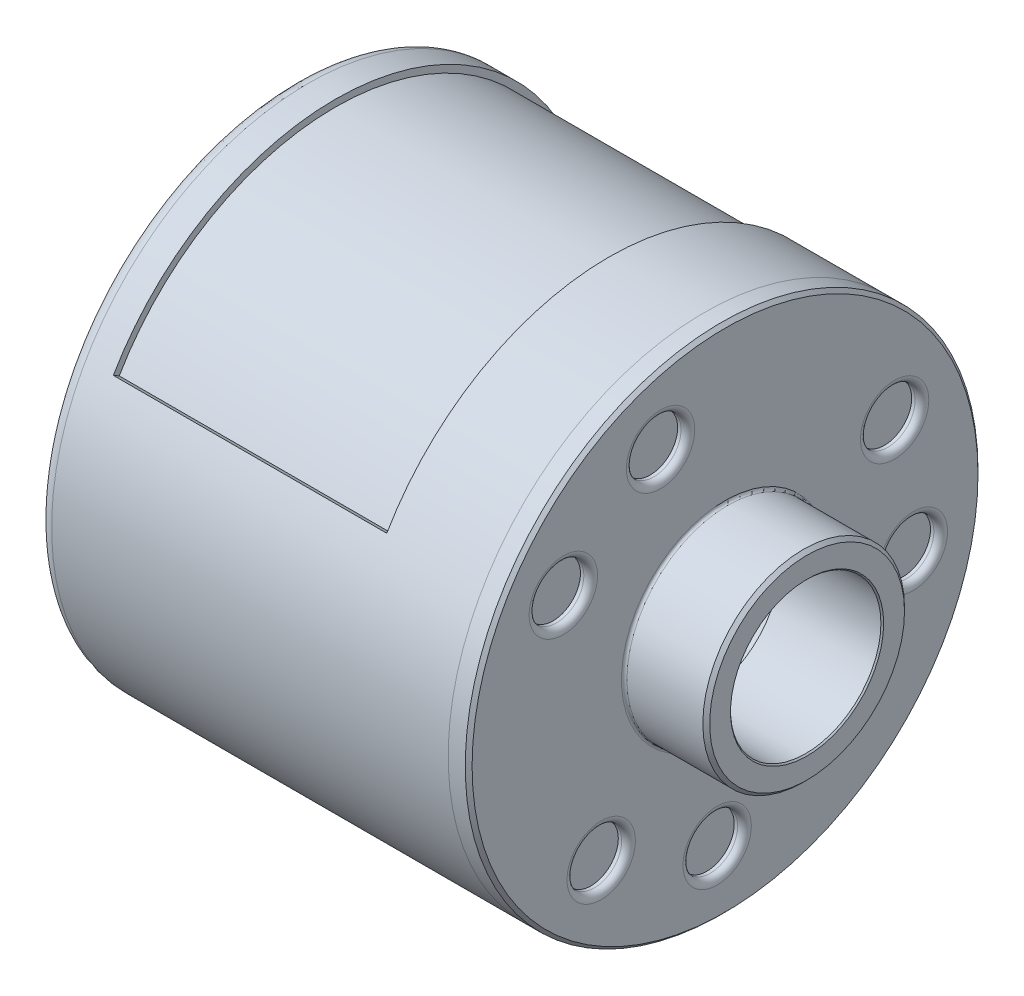
ISO-10303-21;
HEADER;
FILE_DESCRIPTION(('STEP AP214'),'2;1');
FILE_NAME('part.step','',(''),(''),'','','');
FILE_SCHEMA(('AUTOMOTIVE_DESIGN { 1 0 10303 214 1 1 1 1 }'));
ENDSEC;
DATA;
#1=APPLICATION_CONTEXT('core data for automotive mechanical design processes');
#2=APPLICATION_PROTOCOL_DEFINITION('international standard','automotive_design',2000,#1);
#3=PRODUCT_CONTEXT('',#1,'mechanical');
#4=PRODUCT('Part','Part','',(#3));
#5=PRODUCT_RELATED_PRODUCT_CATEGORY('part','',(#4));
#6=PRODUCT_DEFINITION_FORMATION('','',#4);
#7=PRODUCT_DEFINITION_CONTEXT('part definition',#1,'design');
#8=PRODUCT_DEFINITION('design','',#6,#7);
#9=PRODUCT_DEFINITION_SHAPE('','',#8);
#10=(LENGTH_UNIT() NAMED_UNIT(*) SI_UNIT(.MILLI.,.METRE.));
#11=(NAMED_UNIT(*) PLANE_ANGLE_UNIT() SI_UNIT($,.RADIAN.));
#12=(NAMED_UNIT(*) SI_UNIT($,.STERADIAN.) SOLID_ANGLE_UNIT());
#13=UNCERTAINTY_MEASURE_WITH_UNIT(LENGTH_MEASURE(1.E-05),#10,'distance_accuracy_value','');
#14=(GEOMETRIC_REPRESENTATION_CONTEXT(3) GLOBAL_UNCERTAINTY_ASSIGNED_CONTEXT((#13)) GLOBAL_UNIT_ASSIGNED_CONTEXT((#10,
#11,#12)) REPRESENTATION_CONTEXT('',''));
#15=CARTESIAN_POINT('',(0.,0.,0.));
#16=DIRECTION('',(0.,0.,1.));
#17=DIRECTION('',(1.,0.,0.));
#18=AXIS2_PLACEMENT_3D('',#15,#16,#17);
#19=CARTESIAN_POINT('',(63.,0.,0.));
#20=DIRECTION('',(-1.,0.,0.));
#21=DIRECTION('',(0.,0.,1.));
#22=AXIS2_PLACEMENT_3D('',#19,#20,#21);
#23=CYLINDRICAL_SURFACE('',#22,37.5);
#24=CARTESIAN_POINT('',(62.5,0.,0.));
#25=DIRECTION('',(1.,0.,0.));
#26=DIRECTION('',(0.,0.,-1.));
#27=AXIS2_PLACEMENT_3D('',#24,#25,#26);
#28=CIRCLE('',#27,37.5);
#29=CARTESIAN_POINT('',(62.5,0.,-37.5));
#30=VERTEX_POINT('',#29);
#31=EDGE_CURVE('E107',#30,#30,#28,.F.);
#32=ORIENTED_EDGE('',*,*,#31,.T.);
#33=EDGE_LOOP('',(#32));
#34=FACE_BOUND('',#33,.T.);
#35=CARTESIAN_POINT('',(60.,0.,0.));
#36=DIRECTION('',(1.,0.,0.));
#37=DIRECTION('',(0.,0.,-1.));
#38=AXIS2_PLACEMENT_3D('',#35,#36,#37);
#39=CIRCLE('',#38,37.5);
#40=CARTESIAN_POINT('',(60.,0.,-37.5));
#41=VERTEX_POINT('',#40);
#42=EDGE_CURVE('E94',#41,#41,#39,.T.);
#43=ORIENTED_EDGE('',*,*,#42,.T.);
#44=EDGE_LOOP('',(#43));
#45=FACE_BOUND('',#44,.T.);
#46=ADVANCED_FACE('F46',(#34,#45),#23,.T.);
#47=CARTESIAN_POINT('',(63.,0.,0.));
#48=DIRECTION('',(1.,0.,0.));
#49=DIRECTION('',(0.,0.,-1.));
#50=AXIS2_PLACEMENT_3D('',#47,#48,#49);
#51=PLANE('',#50);
#52=CARTESIAN_POINT('',(63.,14.9873391476045,23.6512085372952));
#53=DIRECTION('',(1.,0.,0.));
#54=DIRECTION('',(0.,0.,-1.));
#55=AXIS2_PLACEMENT_3D('',#52,#53,#54);
#56=CIRCLE('',#55,5.);
#57=CARTESIAN_POINT('',(63.,14.9873391476045,18.6512085372952));
#58=VERTEX_POINT('',#57);
#59=EDGE_CURVE('E57',#58,#58,#56,.F.);
#60=ORIENTED_EDGE('',*,*,#59,.T.);
#61=EDGE_LOOP('',(#60));
#62=FACE_BOUND('',#61,.T.);
#63=CARTESIAN_POINT('',(63.,-27.9762169973053,1.15381216831106));
#64=DIRECTION('',(1.,0.,0.));
#65=DIRECTION('',(0.,0.,-1.));
#66=AXIS2_PLACEMENT_3D('',#63,#64,#65);
#67=CIRCLE('',#66,5.);
#68=CARTESIAN_POINT('',(63.,-27.9762169973053,-3.84618783168894));
#69=VERTEX_POINT('',#68);
#70=EDGE_CURVE('E61',#69,#69,#67,.F.);
#71=ORIENTED_EDGE('',*,*,#70,.T.);
#72=EDGE_LOOP('',(#71));
#73=FACE_BOUND('',#72,.T.);
#74=CARTESIAN_POINT('',(63.,12.9888778496976,-24.8050207056078));
#75=DIRECTION('',(1.,0.,0.));
#76=DIRECTION('',(0.,0.,-1.));
#77=AXIS2_PLACEMENT_3D('',#74,#75,#76);
#78=CIRCLE('',#77,5.);
#79=CARTESIAN_POINT('',(63.,12.9888778496976,-29.8050207056078));
#80=VERTEX_POINT('',#79);
#81=EDGE_CURVE('E66',#80,#80,#78,.F.);
#82=ORIENTED_EDGE('',*,*,#81,.T.);
#83=EDGE_LOOP('',(#82));
#84=FACE_BOUND('',#83,.T.);
#85=CARTESIAN_POINT('',(63.,-21.3516493882719,18.1137259667996));
#86=DIRECTION('',(1.,0.,0.));
#87=DIRECTION('',(0.,0.,-1.));
#88=AXIS2_PLACEMENT_3D('',#85,#86,#87);
#89=CIRCLE('',#88,5.);
#90=CARTESIAN_POINT('',(63.,-21.3516493882719,13.1137259667996));
#91=VERTEX_POINT('',#90);
#92=EDGE_CURVE('E75',#91,#91,#89,.F.);
#93=ORIENTED_EDGE('',*,*,#92,.T.);
#94=EDGE_LOOP('',(#93));
#95=FACE_BOUND('',#94,.T.);
#96=CARTESIAN_POINT('',(63.,26.3627715385742,9.43420779954214));
#97=DIRECTION('',(1.,0.,0.));
#98=DIRECTION('',(0.,0.,-1.));
#99=AXIS2_PLACEMENT_3D('',#96,#97,#98);
#100=CIRCLE('',#99,5.);
#101=CARTESIAN_POINT('',(63.,26.3627715385742,4.43420779954214));
#102=VERTEX_POINT('',#101);
#103=EDGE_CURVE('E78',#102,#102,#100,.F.);
#104=ORIENTED_EDGE('',*,*,#103,.T.);
#105=EDGE_LOOP('',(#104));
#106=FACE_BOUND('',#105,.T.);
#107=CARTESIAN_POINT('',(63.,-5.01112215030235,-27.5479337663417));
#108=DIRECTION('',(1.,0.,0.));
#109=DIRECTION('',(0.,0.,-1.));
#110=AXIS2_PLACEMENT_3D('',#107,#108,#109);
#111=CIRCLE('',#110,5.);
#112=CARTESIAN_POINT('',(63.,-5.01112215030235,-32.5479337663417));
#113=VERTEX_POINT('',#112);
#114=EDGE_CURVE('E84',#113,#113,#111,.F.);
#115=ORIENTED_EDGE('',*,*,#114,.T.);
#116=EDGE_LOOP('',(#115));
#117=FACE_BOUND('',#116,.T.);
#118=CARTESIAN_POINT('',(63.,0.,0.));
#119=DIRECTION('',(1.,0.,0.));
#120=DIRECTION('',(0.,0.,-1.));
#121=AXIS2_PLACEMENT_3D('',#118,#119,#120);
#122=CIRCLE('',#121,37.);
#123=CARTESIAN_POINT('',(63.,0.,-37.));
#124=VERTEX_POINT('',#123);
#125=EDGE_CURVE('E110',#124,#124,#122,.T.);
#126=ORIENTED_EDGE('',*,*,#125,.T.);
#127=EDGE_LOOP('',(#126));
#128=FACE_BOUND('',#127,.T.);
#129=CARTESIAN_POINT('',(63.,0.,0.));
#130=DIRECTION('',(1.,0.,0.));
#131=DIRECTION('',(0.,0.,-1.));
#132=AXIS2_PLACEMENT_3D('',#129,#130,#131);
#133=CIRCLE('',#132,15.15);
#134=CARTESIAN_POINT('',(63.,0.,-15.15));
#135=VERTEX_POINT('',#134);
#136=EDGE_CURVE('E113',#135,#135,#133,.F.);
#137=ORIENTED_EDGE('',*,*,#136,.T.);
#138=EDGE_LOOP('',(#137));
#139=FACE_BOUND('',#138,.T.);
#140=ADVANCED_FACE('F157',(#62,#73,#84,#95,#106,#117,#128,#139),#51,.T.);
#141=CARTESIAN_POINT('',(60.,0.,0.));
#142=DIRECTION('',(1.,0.,0.));
#143=DIRECTION('',(0.,0.,-1.));
#144=AXIS2_PLACEMENT_3D('',#141,#142,#143);
#145=PLANE('',#144);
#146=CARTESIAN_POINT('',(60.,0.,0.));
#147=DIRECTION('',(1.,0.,0.));
#148=DIRECTION('',(0.,0.,-1.));
#149=AXIS2_PLACEMENT_3D('',#146,#147,#148);
#150=CIRCLE('',#149,11.);
#151=CARTESIAN_POINT('',(60.,0.,-11.));
#152=VERTEX_POINT('',#151);
#153=EDGE_CURVE('E91',#152,#152,#150,.T.);
#154=ORIENTED_EDGE('',*,*,#153,.T.);
#155=EDGE_LOOP('',(#154));
#156=FACE_BOUND('',#155,.T.);
#157=ORIENTED_EDGE('',*,*,#42,.F.);
#158=EDGE_LOOP('',(#157));
#159=FACE_BOUND('',#158,.T.);
#160=ADVANCED_FACE('F163',(#156,#159),#145,.F.);
#161=CARTESIAN_POINT('',(75.,0.,0.));
#162=DIRECTION('',(-1.,0.,0.));
#163=DIRECTION('',(0.,0.,1.));
#164=AXIS2_PLACEMENT_3D('',#161,#162,#163);
#165=CYLINDRICAL_SURFACE('',#164,11.);
#166=CARTESIAN_POINT('',(74.8,0.,0.));
#167=DIRECTION('',(1.,0.,0.));
#168=DIRECTION('',(0.,0.,-1.));
#169=AXIS2_PLACEMENT_3D('',#166,#167,#168);
#170=CIRCLE('',#169,11.);
#171=CARTESIAN_POINT('',(74.8,0.,-11.));
#172=VERTEX_POINT('',#171);
#173=EDGE_CURVE('E98',#172,#172,#170,.T.);
#174=ORIENTED_EDGE('',*,*,#173,.T.);
#175=EDGE_LOOP('',(#174));
#176=FACE_BOUND('',#175,.T.);
#177=ORIENTED_EDGE('',*,*,#153,.F.);
#178=EDGE_LOOP('',(#177));
#179=FACE_BOUND('',#178,.T.);
#180=ADVANCED_FACE('F229',(#176,#179),#165,.F.);
#181=CARTESIAN_POINT('',(75.,0.,0.));
#182=DIRECTION('',(-1.,0.,0.));
#183=DIRECTION('',(0.,0.,1.));
#184=AXIS2_PLACEMENT_3D('',#181,#182,#183);
#185=CYLINDRICAL_SURFACE('',#184,14.75);
#186=CARTESIAN_POINT('',(74.5,0.,0.));
#187=DIRECTION('',(1.,0.,0.));
#188=DIRECTION('',(0.,0.,-1.));
#189=AXIS2_PLACEMENT_3D('',#186,#187,#188);
#190=CIRCLE('',#189,14.75);
#191=CARTESIAN_POINT('',(74.5,0.,-14.75));
#192=VERTEX_POINT('',#191);
#193=EDGE_CURVE('E101',#192,#192,#190,.F.);
#194=ORIENTED_EDGE('',*,*,#193,.T.);
#195=EDGE_LOOP('',(#194));
#196=FACE_BOUND('',#195,.T.);
#197=CARTESIAN_POINT('',(63.4,0.,0.));
#198=DIRECTION('',(1.,0.,0.));
#199=DIRECTION('',(0.,0.,-1.));
#200=AXIS2_PLACEMENT_3D('',#197,#198,#199);
#201=CIRCLE('',#200,14.75);
#202=CARTESIAN_POINT('',(63.4,0.,-14.75));
#203=VERTEX_POINT('',#202);
#204=EDGE_CURVE('E116',#203,#203,#201,.T.);
#205=ORIENTED_EDGE('',*,*,#204,.T.);
#206=EDGE_LOOP('',(#205));
#207=FACE_BOUND('',#206,.T.);
#208=ADVANCED_FACE('F227',(#196,#207),#185,.T.);
#209=CARTESIAN_POINT('',(75.,0.,0.));
#210=DIRECTION('',(1.,0.,0.));
#211=DIRECTION('',(0.,0.,-1.));
#212=AXIS2_PLACEMENT_3D('',#209,#210,#211);
#213=PLANE('',#212);
#214=CARTESIAN_POINT('',(75.,0.,0.));
#215=DIRECTION('',(1.,0.,0.));
#216=DIRECTION('',(0.,0.,-1.));
#217=AXIS2_PLACEMENT_3D('',#214,#215,#216);
#218=CIRCLE('',#217,11.2);
#219=CARTESIAN_POINT('',(75.,0.,-11.2));
#220=VERTEX_POINT('',#219);
#221=EDGE_CURVE('E90',#220,#220,#218,.F.);
#222=ORIENTED_EDGE('',*,*,#221,.T.);
#223=EDGE_LOOP('',(#222));
#224=FACE_BOUND('',#223,.T.);
#225=CARTESIAN_POINT('',(75.,0.,0.));
#226=DIRECTION('',(1.,0.,0.));
#227=DIRECTION('',(0.,0.,-1.));
#228=AXIS2_PLACEMENT_3D('',#225,#226,#227);
#229=CIRCLE('',#228,14.25);
#230=CARTESIAN_POINT('',(75.,0.,-14.25));
#231=VERTEX_POINT('',#230);
#232=EDGE_CURVE('E104',#231,#231,#229,.T.);
#233=ORIENTED_EDGE('',*,*,#232,.T.);
#234=EDGE_LOOP('',(#233));
#235=FACE_BOUND('',#234,.T.);
#236=ADVANCED_FACE('F173',(#224,#235),#213,.T.);
#237=CARTESIAN_POINT('',(63.4,0.,0.));
#238=DIRECTION('',(1.,0.,0.));
#239=DIRECTION('',(0.,0.,-1.));
#240=AXIS2_PLACEMENT_3D('',#237,#238,#239);
#241=TOROIDAL_SURFACE('',#240,15.15,0.4);
#242=ORIENTED_EDGE('',*,*,#136,.F.);
#243=EDGE_LOOP('',(#242));
#244=FACE_BOUND('',#243,.T.);
#245=ORIENTED_EDGE('',*,*,#204,.F.);
#246=EDGE_LOOP('',(#245));
#247=FACE_BOUND('',#246,.T.);
#248=ADVANCED_FACE('F169',(#244,#247),#241,.F.);
#249=CARTESIAN_POINT('',(63.,0.,0.));
#250=DIRECTION('',(-1.,0.,0.));
#251=DIRECTION('',(0.,0.,1.));
#252=AXIS2_PLACEMENT_3D('',#249,#250,#251);
#253=CONICAL_SURFACE('',#252,37.,0.785398163397455);
#254=ORIENTED_EDGE('',*,*,#31,.F.);
#255=EDGE_LOOP('',(#254));
#256=FACE_BOUND('',#255,.T.);
#257=ORIENTED_EDGE('',*,*,#125,.F.);
#258=EDGE_LOOP('',(#257));
#259=FACE_BOUND('',#258,.T.);
#260=ADVANCED_FACE('F172',(#256,#259),#253,.T.);
#261=CARTESIAN_POINT('',(75.,0.,0.));
#262=DIRECTION('',(-1.,0.,0.));
#263=DIRECTION('',(0.,0.,1.));
#264=AXIS2_PLACEMENT_3D('',#261,#262,#263);
#265=CONICAL_SURFACE('',#264,14.25,0.785398163397452);
#266=ORIENTED_EDGE('',*,*,#193,.F.);
#267=EDGE_LOOP('',(#266));
#268=FACE_BOUND('',#267,.T.);
#269=ORIENTED_EDGE('',*,*,#232,.F.);
#270=EDGE_LOOP('',(#269));
#271=FACE_BOUND('',#270,.T.);
#272=ADVANCED_FACE('F177',(#268,#271),#265,.T.);
#273=CARTESIAN_POINT('',(74.8,0.,0.));
#274=DIRECTION('',(1.,0.,0.));
#275=DIRECTION('',(0.,0.,-1.));
#276=AXIS2_PLACEMENT_3D('',#273,#274,#275);
#277=CONICAL_SURFACE('',#276,11.,0.785398163397479);
#278=ORIENTED_EDGE('',*,*,#221,.F.);
#279=EDGE_LOOP('',(#278));
#280=FACE_BOUND('',#279,.T.);
#281=ORIENTED_EDGE('',*,*,#173,.F.);
#282=EDGE_LOOP('',(#281));
#283=FACE_BOUND('',#282,.T.);
#284=ADVANCED_FACE('F181',(#280,#283),#277,.F.);
#285=CARTESIAN_POINT('',(61.5,12.9888778496976,-24.8050207056078));
#286=DIRECTION('',(1.,0.,0.));
#287=DIRECTION('',(0.,0.,-1.));
#288=AXIS2_PLACEMENT_3D('',#285,#286,#287);
#289=CYLINDRICAL_SURFACE('',#288,4.);
#290=CARTESIAN_POINT('',(62.,12.9888778496976,-24.8050207056078));
#291=DIRECTION('',(1.,0.,0.));
#292=DIRECTION('',(0.,0.,-1.));
#293=AXIS2_PLACEMENT_3D('',#290,#291,#292);
#294=CIRCLE('',#293,4.);
#295=CARTESIAN_POINT('',(62.,12.9888778496976,-28.8050207056078));
#296=VERTEX_POINT('',#295);
#297=EDGE_CURVE('E11',#296,#296,#294,.T.);
#298=ORIENTED_EDGE('',*,*,#297,.T.);
#299=EDGE_LOOP('',(#298));
#300=FACE_BOUND('',#299,.T.);
#301=CARTESIAN_POINT('',(61.5,12.9888778496976,-24.8050207056078));
#302=DIRECTION('',(1.,0.,0.));
#303=DIRECTION('',(0.,0.,-1.));
#304=AXIS2_PLACEMENT_3D('',#301,#302,#303);
#305=CIRCLE('',#304,4.);
#306=CARTESIAN_POINT('',(61.5,12.9888778496976,-28.8050207056078));
#307=VERTEX_POINT('',#306);
#308=EDGE_CURVE('E95',#307,#307,#305,.T.);
#309=ORIENTED_EDGE('',*,*,#308,.F.);
#310=EDGE_LOOP('',(#309));
#311=FACE_BOUND('',#310,.T.);
#312=ADVANCED_FACE('F152',(#300,#311),#289,.F.);
#313=CARTESIAN_POINT('',(61.5,12.9888778496976,-24.8050207056078));
#314=DIRECTION('',(1.,0.,0.));
#315=DIRECTION('',(0.,0.,-1.));
#316=AXIS2_PLACEMENT_3D('',#313,#314,#315);
#317=PLANE('',#316);
#318=ORIENTED_EDGE('',*,*,#308,.T.);
#319=EDGE_LOOP('',(#318));
#320=FACE_BOUND('',#319,.T.);
#321=ADVANCED_FACE('F143',(#320),#317,.T.);
#322=CARTESIAN_POINT('',(61.5,14.9873391476045,23.6512085372952));
#323=DIRECTION('',(1.,0.,0.));
#324=DIRECTION('',(0.,0.,-1.));
#325=AXIS2_PLACEMENT_3D('',#322,#323,#324);
#326=CYLINDRICAL_SURFACE('',#325,4.);
#327=CARTESIAN_POINT('',(62.,14.9873391476045,23.6512085372952));
#328=DIRECTION('',(1.,0.,0.));
#329=DIRECTION('',(0.,0.,-1.));
#330=AXIS2_PLACEMENT_3D('',#327,#328,#329);
#331=CIRCLE('',#330,4.);
#332=CARTESIAN_POINT('',(62.,14.9873391476045,19.6512085372952));
#333=VERTEX_POINT('',#332);
#334=EDGE_CURVE('E69',#333,#333,#331,.T.);
#335=ORIENTED_EDGE('',*,*,#334,.T.);
#336=EDGE_LOOP('',(#335));
#337=FACE_BOUND('',#336,.T.);
#338=CARTESIAN_POINT('',(61.5,14.9873391476045,23.6512085372952));
#339=DIRECTION('',(1.,0.,0.));
#340=DIRECTION('',(0.,0.,-1.));
#341=AXIS2_PLACEMENT_3D('',#338,#339,#340);
#342=CIRCLE('',#341,4.);
#343=CARTESIAN_POINT('',(61.5,14.9873391476045,19.6512085372952));
#344=VERTEX_POINT('',#343);
#345=EDGE_CURVE('E133',#344,#344,#342,.T.);
#346=ORIENTED_EDGE('',*,*,#345,.F.);
#347=EDGE_LOOP('',(#346));
#348=FACE_BOUND('',#347,.T.);
#349=ADVANCED_FACE('F141',(#337,#348),#326,.F.);
#350=CARTESIAN_POINT('',(61.5,14.9873391476045,23.6512085372952));
#351=DIRECTION('',(1.,0.,0.));
#352=DIRECTION('',(0.,0.,-1.));
#353=AXIS2_PLACEMENT_3D('',#350,#351,#352);
#354=PLANE('',#353);
#355=ORIENTED_EDGE('',*,*,#345,.T.);
#356=EDGE_LOOP('',(#355));
#357=FACE_BOUND('',#356,.T.);
#358=ADVANCED_FACE('F139',(#357),#354,.T.);
#359=CARTESIAN_POINT('',(61.5,-5.01112215030235,-27.5479337663417));
#360=DIRECTION('',(1.,0.,0.));
#361=DIRECTION('',(0.,0.,-1.));
#362=AXIS2_PLACEMENT_3D('',#359,#360,#361);
#363=CYLINDRICAL_SURFACE('',#362,4.);
#364=CARTESIAN_POINT('',(62.,-5.01112215030235,-27.5479337663417));
#365=DIRECTION('',(1.,0.,0.));
#366=DIRECTION('',(0.,0.,-1.));
#367=AXIS2_PLACEMENT_3D('',#364,#365,#366);
#368=CIRCLE('',#367,4.);
#369=CARTESIAN_POINT('',(62.,-5.01112215030235,-31.5479337663417));
#370=VERTEX_POINT('',#369);
#371=EDGE_CURVE('E87',#370,#370,#368,.T.);
#372=ORIENTED_EDGE('',*,*,#371,.T.);
#373=EDGE_LOOP('',(#372));
#374=FACE_BOUND('',#373,.T.);
#375=CARTESIAN_POINT('',(61.5,-5.01112215030235,-27.5479337663417));
#376=DIRECTION('',(1.,0.,0.));
#377=DIRECTION('',(0.,0.,-1.));
#378=AXIS2_PLACEMENT_3D('',#375,#376,#377);
#379=CIRCLE('',#378,4.);
#380=CARTESIAN_POINT('',(61.5,-5.01112215030235,-31.5479337663417));
#381=VERTEX_POINT('',#380);
#382=EDGE_CURVE('E123',#381,#381,#379,.T.);
#383=ORIENTED_EDGE('',*,*,#382,.F.);
#384=EDGE_LOOP('',(#383));
#385=FACE_BOUND('',#384,.T.);
#386=ADVANCED_FACE('F150',(#374,#385),#363,.F.);
#387=CARTESIAN_POINT('',(61.5,-5.01112215030235,-27.5479337663417));
#388=DIRECTION('',(1.,0.,0.));
#389=DIRECTION('',(0.,0.,-1.));
#390=AXIS2_PLACEMENT_3D('',#387,#388,#389);
#391=PLANE('',#390);
#392=ORIENTED_EDGE('',*,*,#382,.T.);
#393=EDGE_LOOP('',(#392));
#394=FACE_BOUND('',#393,.T.);
#395=ADVANCED_FACE('F247',(#394),#391,.T.);
#396=CARTESIAN_POINT('',(61.5,-21.3516493882719,18.1137259667996));
#397=DIRECTION('',(1.,0.,0.));
#398=DIRECTION('',(0.,0.,-1.));
#399=AXIS2_PLACEMENT_3D('',#396,#397,#398);
#400=CYLINDRICAL_SURFACE('',#399,4.);
#401=CARTESIAN_POINT('',(62.,-21.3516493882719,18.1137259667996));
#402=DIRECTION('',(1.,0.,0.));
#403=DIRECTION('',(0.,0.,-1.));
#404=AXIS2_PLACEMENT_3D('',#401,#402,#403);
#405=CIRCLE('',#404,4.);
#406=CARTESIAN_POINT('',(62.,-21.3516493882719,14.1137259667996));
#407=VERTEX_POINT('',#406);
#408=EDGE_CURVE('E81',#407,#407,#405,.T.);
#409=ORIENTED_EDGE('',*,*,#408,.T.);
#410=EDGE_LOOP('',(#409));
#411=FACE_BOUND('',#410,.T.);
#412=CARTESIAN_POINT('',(61.5,-21.3516493882719,18.1137259667996));
#413=DIRECTION('',(1.,0.,0.));
#414=DIRECTION('',(0.,0.,-1.));
#415=AXIS2_PLACEMENT_3D('',#412,#413,#414);
#416=CIRCLE('',#415,4.);
#417=CARTESIAN_POINT('',(61.5,-21.3516493882719,14.1137259667996));
#418=VERTEX_POINT('',#417);
#419=EDGE_CURVE('E124',#418,#418,#416,.T.);
#420=ORIENTED_EDGE('',*,*,#419,.F.);
#421=EDGE_LOOP('',(#420));
#422=FACE_BOUND('',#421,.T.);
#423=ADVANCED_FACE('F243',(#411,#422),#400,.F.);
#424=CARTESIAN_POINT('',(61.5,-21.3516493882719,18.1137259667996));
#425=DIRECTION('',(1.,0.,0.));
#426=DIRECTION('',(0.,0.,-1.));
#427=AXIS2_PLACEMENT_3D('',#424,#425,#426);
#428=PLANE('',#427);
#429=ORIENTED_EDGE('',*,*,#419,.T.);
#430=EDGE_LOOP('',(#429));
#431=FACE_BOUND('',#430,.T.);
#432=ADVANCED_FACE('F246',(#431),#428,.T.);
#433=CARTESIAN_POINT('',(61.5,26.3627715385742,9.43420779954214));
#434=DIRECTION('',(1.,0.,0.));
#435=DIRECTION('',(0.,0.,-1.));
#436=AXIS2_PLACEMENT_3D('',#433,#434,#435);
#437=CYLINDRICAL_SURFACE('',#436,4.);
#438=CARTESIAN_POINT('',(62.,26.3627715385742,9.43420779954214));
#439=DIRECTION('',(1.,0.,0.));
#440=DIRECTION('',(0.,0.,-1.));
#441=AXIS2_PLACEMENT_3D('',#438,#439,#440);
#442=CIRCLE('',#441,4.);
#443=CARTESIAN_POINT('',(62.,26.3627715385742,5.43420779954214));
#444=VERTEX_POINT('',#443);
#445=EDGE_CURVE('E72',#444,#444,#442,.T.);
#446=ORIENTED_EDGE('',*,*,#445,.T.);
#447=EDGE_LOOP('',(#446));
#448=FACE_BOUND('',#447,.T.);
#449=CARTESIAN_POINT('',(61.5,26.3627715385742,9.43420779954214));
#450=DIRECTION('',(1.,0.,0.));
#451=DIRECTION('',(0.,0.,-1.));
#452=AXIS2_PLACEMENT_3D('',#449,#450,#451);
#453=CIRCLE('',#452,4.);
#454=CARTESIAN_POINT('',(61.5,26.3627715385742,5.43420779954214));
#455=VERTEX_POINT('',#454);
#456=EDGE_CURVE('E127',#455,#455,#453,.T.);
#457=ORIENTED_EDGE('',*,*,#456,.F.);
#458=EDGE_LOOP('',(#457));
#459=FACE_BOUND('',#458,.T.);
#460=ADVANCED_FACE('F251',(#448,#459),#437,.F.);
#461=CARTESIAN_POINT('',(61.5,26.3627715385742,9.43420779954214));
#462=DIRECTION('',(1.,0.,0.));
#463=DIRECTION('',(0.,0.,-1.));
#464=AXIS2_PLACEMENT_3D('',#461,#462,#463);
#465=PLANE('',#464);
#466=ORIENTED_EDGE('',*,*,#456,.T.);
#467=EDGE_LOOP('',(#466));
#468=FACE_BOUND('',#467,.T.);
#469=ADVANCED_FACE('F262',(#468),#465,.T.);
#470=CARTESIAN_POINT('',(61.5,-27.9762169973053,1.15381216831106));
#471=DIRECTION('',(1.,0.,0.));
#472=DIRECTION('',(0.,0.,-1.));
#473=AXIS2_PLACEMENT_3D('',#470,#471,#472);
#474=CYLINDRICAL_SURFACE('',#473,4.);
#475=CARTESIAN_POINT('',(62.,-27.9762169973053,1.15381216831106));
#476=DIRECTION('',(1.,0.,0.));
#477=DIRECTION('',(0.,0.,-1.));
#478=AXIS2_PLACEMENT_3D('',#475,#476,#477);
#479=CIRCLE('',#478,4.);
#480=CARTESIAN_POINT('',(62.,-27.9762169973053,-2.84618783168894));
#481=VERTEX_POINT('',#480);
#482=EDGE_CURVE('E53',#481,#481,#479,.T.);
#483=ORIENTED_EDGE('',*,*,#482,.T.);
#484=EDGE_LOOP('',(#483));
#485=FACE_BOUND('',#484,.T.);
#486=CARTESIAN_POINT('',(61.5,-27.9762169973053,1.15381216831106));
#487=DIRECTION('',(1.,0.,0.));
#488=DIRECTION('',(0.,0.,-1.));
#489=AXIS2_PLACEMENT_3D('',#486,#487,#488);
#490=CIRCLE('',#489,4.);
#491=CARTESIAN_POINT('',(61.5,-27.9762169973053,-2.84618783168894));
#492=VERTEX_POINT('',#491);
#493=EDGE_CURVE('E130',#492,#492,#490,.T.);
#494=ORIENTED_EDGE('',*,*,#493,.F.);
#495=EDGE_LOOP('',(#494));
#496=FACE_BOUND('',#495,.T.);
#497=ADVANCED_FACE('F259',(#485,#496),#474,.F.);
#498=CARTESIAN_POINT('',(61.5,-27.9762169973053,1.15381216831106));
#499=DIRECTION('',(1.,0.,0.));
#500=DIRECTION('',(0.,0.,-1.));
#501=AXIS2_PLACEMENT_3D('',#498,#499,#500);
#502=PLANE('',#501);
#503=ORIENTED_EDGE('',*,*,#493,.T.);
#504=EDGE_LOOP('',(#503));
#505=FACE_BOUND('',#504,.T.);
#506=ADVANCED_FACE('F190',(#505),#502,.T.);
#507=CARTESIAN_POINT('',(62.,-5.01112215030235,-27.5479337663417));
#508=DIRECTION('',(1.,0.,0.));
#509=DIRECTION('',(0.,0.,-1.));
#510=AXIS2_PLACEMENT_3D('',#507,#508,#509);
#511=TOROIDAL_SURFACE('',#510,5.,1.);
#512=ORIENTED_EDGE('',*,*,#114,.F.);
#513=EDGE_LOOP('',(#512));
#514=FACE_BOUND('',#513,.T.);
#515=ORIENTED_EDGE('',*,*,#371,.F.);
#516=EDGE_LOOP('',(#515));
#517=FACE_BOUND('',#516,.T.);
#518=ADVANCED_FACE('F186',(#514,#517),#511,.T.);
#519=CARTESIAN_POINT('',(62.,-21.3516493882719,18.1137259667996));
#520=DIRECTION('',(1.,0.,0.));
#521=DIRECTION('',(0.,0.,-1.));
#522=AXIS2_PLACEMENT_3D('',#519,#520,#521);
#523=TOROIDAL_SURFACE('',#522,5.,1.);
#524=ORIENTED_EDGE('',*,*,#92,.F.);
#525=EDGE_LOOP('',(#524));
#526=FACE_BOUND('',#525,.T.);
#527=ORIENTED_EDGE('',*,*,#408,.F.);
#528=EDGE_LOOP('',(#527));
#529=FACE_BOUND('',#528,.T.);
#530=ADVANCED_FACE('F189',(#526,#529),#523,.T.);
#531=CARTESIAN_POINT('',(62.,26.3627715385742,9.43420779954214));
#532=DIRECTION('',(1.,0.,0.));
#533=DIRECTION('',(0.,0.,-1.));
#534=AXIS2_PLACEMENT_3D('',#531,#532,#533);
#535=TOROIDAL_SURFACE('',#534,5.,1.);
#536=ORIENTED_EDGE('',*,*,#103,.F.);
#537=EDGE_LOOP('',(#536));
#538=FACE_BOUND('',#537,.T.);
#539=ORIENTED_EDGE('',*,*,#445,.F.);
#540=EDGE_LOOP('',(#539));
#541=FACE_BOUND('',#540,.T.);
#542=ADVANCED_FACE('F194',(#538,#541),#535,.T.);
#543=CARTESIAN_POINT('',(62.,14.9873391476045,23.6512085372952));
#544=DIRECTION('',(1.,0.,0.));
#545=DIRECTION('',(0.,0.,-1.));
#546=AXIS2_PLACEMENT_3D('',#543,#544,#545);
#547=TOROIDAL_SURFACE('',#546,5.,1.);
#548=ORIENTED_EDGE('',*,*,#59,.F.);
#549=EDGE_LOOP('',(#548));
#550=FACE_BOUND('',#549,.T.);
#551=ORIENTED_EDGE('',*,*,#334,.F.);
#552=EDGE_LOOP('',(#551));
#553=FACE_BOUND('',#552,.T.);
#554=ADVANCED_FACE('F198',(#550,#553),#547,.T.);
#555=CARTESIAN_POINT('',(62.,-27.9762169973053,1.15381216831106));
#556=DIRECTION('',(1.,0.,0.));
#557=DIRECTION('',(0.,0.,-1.));
#558=AXIS2_PLACEMENT_3D('',#555,#556,#557);
#559=TOROIDAL_SURFACE('',#558,5.,1.);
#560=ORIENTED_EDGE('',*,*,#70,.F.);
#561=EDGE_LOOP('',(#560));
#562=FACE_BOUND('',#561,.T.);
#563=ORIENTED_EDGE('',*,*,#482,.F.);
#564=EDGE_LOOP('',(#563));
#565=FACE_BOUND('',#564,.T.);
#566=ADVANCED_FACE('F201',(#562,#565),#559,.T.);
#567=CARTESIAN_POINT('',(62.,12.9888778496976,-24.8050207056078));
#568=DIRECTION('',(1.,0.,0.));
#569=DIRECTION('',(0.,0.,-1.));
#570=AXIS2_PLACEMENT_3D('',#567,#568,#569);
#571=TOROIDAL_SURFACE('',#570,5.,1.);
#572=ORIENTED_EDGE('',*,*,#81,.F.);
#573=EDGE_LOOP('',(#572));
#574=FACE_BOUND('',#573,.T.);
#575=ORIENTED_EDGE('',*,*,#297,.F.);
#576=EDGE_LOOP('',(#575));
#577=FACE_BOUND('',#576,.T.);
#578=ADVANCED_FACE('F48',(#574,#577),#571,.T.);
#579=CLOSED_SHELL('',(#46,#140,#160,#180,#208,#236,#248,#260,#272,#284,#312,#321,#349,#358,#386,
#395,#423,#432,#460,#469,#497,#506,#518,#530,#542,#554,#566,#578));
#580=MANIFOLD_SOLID_BREP('B2',#579);
#581=CARTESIAN_POINT('',(60.,0.,0.));
#582=DIRECTION('',(-1.,0.,0.));
#583=DIRECTION('',(0.,0.,1.));
#584=AXIS2_PLACEMENT_3D('',#581,#582,#583);
#585=CYLINDRICAL_SURFACE('',#584,37.5);
#586=CARTESIAN_POINT('',(60.,0.,0.));
#587=DIRECTION('',(1.,0.,0.));
#588=DIRECTION('',(0.,0.,-1.));
#589=AXIS2_PLACEMENT_3D('',#586,#587,#588);
#590=CIRCLE('',#589,37.5);
#591=CARTESIAN_POINT('',(60.,0.,-37.5));
#592=VERTEX_POINT('',#591);
#593=EDGE_CURVE('E555',#592,#592,#590,.T.);
#594=ORIENTED_EDGE('',*,*,#593,.F.);
#595=EDGE_LOOP('',(#594));
#596=FACE_BOUND('',#595,.T.);
#597=CARTESIAN_POINT('',(2.,0.,0.));
#598=DIRECTION('',(1.,0.,0.));
#599=DIRECTION('',(0.,0.,-1.));
#600=AXIS2_PLACEMENT_3D('',#597,#598,#599);
#601=CIRCLE('',#600,37.5);
#602=CARTESIAN_POINT('',(2.,0.,-37.5));
#603=VERTEX_POINT('',#602);
#604=EDGE_CURVE('E478',#603,#603,#601,.T.);
#605=ORIENTED_EDGE('',*,*,#604,.T.);
#606=EDGE_LOOP('',(#605));
#607=FACE_BOUND('',#606,.T.);
#608=CARTESIAN_POINT('',(6.,0.,0.));
#609=DIRECTION('',(1.,0.,0.));
#610=DIRECTION('',(0.,0.,-1.));
#611=AXIS2_PLACEMENT_3D('',#608,#609,#610);
#612=CIRCLE('',#611,37.5);
#613=CARTESIAN_POINT('',(6.,18.7499999999999,-32.4759526419165));
#614=VERTEX_POINT('',#613);
#615=CARTESIAN_POINT('',(6.,18.7499999999999,32.4759526419165));
#616=VERTEX_POINT('',#615);
#617=EDGE_CURVE('E534',#614,#616,#612,.T.);
#618=ORIENTED_EDGE('',*,*,#617,.F.);
#619=DIRECTION('',(1.,0.,0.));
#620=VECTOR('',#619,1.);
#621=CARTESIAN_POINT('',(6.,18.7499999999999,-32.4759526419165));
#622=LINE('',#621,#620);
#623=CARTESIAN_POINT('',(46.,18.7499999999999,-32.4759526419165));
#624=VERTEX_POINT('',#623);
#625=EDGE_CURVE('E494',#614,#624,#622,.T.);
#626=ORIENTED_EDGE('',*,*,#625,.T.);
#627=CARTESIAN_POINT('',(46.,0.,0.));
#628=DIRECTION('',(1.,0.,0.));
#629=DIRECTION('',(0.,0.,-1.));
#630=AXIS2_PLACEMENT_3D('',#627,#628,#629);
#631=CIRCLE('',#630,37.5);
#632=CARTESIAN_POINT('',(46.,18.7499999999999,32.4759526419165));
#633=VERTEX_POINT('',#632);
#634=EDGE_CURVE('E510',#624,#633,#631,.T.);
#635=ORIENTED_EDGE('',*,*,#634,.T.);
#636=DIRECTION('',(1.,0.,0.));
#637=VECTOR('',#636,1.);
#638=CARTESIAN_POINT('',(6.,18.7499999999999,32.4759526419165));
#639=LINE('',#638,#637);
#640=EDGE_CURVE('E524',#616,#633,#639,.T.);
#641=ORIENTED_EDGE('',*,*,#640,.F.);
#642=EDGE_LOOP('',(#618,#626,#635,#641));
#643=FACE_BOUND('',#642,.T.);
#644=ADVANCED_FACE('F470',(#596,#607,#643),#585,.T.);
#645=CARTESIAN_POINT('',(60.,0.,0.));
#646=DIRECTION('',(1.,0.,0.));
#647=DIRECTION('',(0.,0.,-1.));
#648=AXIS2_PLACEMENT_3D('',#645,#646,#647);
#649=PLANE('',#648);
#650=CARTESIAN_POINT('',(60.,0.,0.));
#651=DIRECTION('',(1.,0.,0.));
#652=DIRECTION('',(0.,0.,-1.));
#653=AXIS2_PLACEMENT_3D('',#650,#651,#652);
#654=CIRCLE('',#653,34.5);
#655=CARTESIAN_POINT('',(60.,0.,-34.5));
#656=VERTEX_POINT('',#655);
#657=EDGE_CURVE('E552',#656,#656,#654,.T.);
#658=ORIENTED_EDGE('',*,*,#657,.F.);
#659=EDGE_LOOP('',(#658));
#660=FACE_BOUND('',#659,.T.);
#661=ORIENTED_EDGE('',*,*,#593,.T.);
#662=EDGE_LOOP('',(#661));
#663=FACE_BOUND('',#662,.T.);
#664=ADVANCED_FACE('F576',(#660,#663),#649,.T.);
#665=CARTESIAN_POINT('',(0.,0.,0.));
#666=DIRECTION('',(1.,0.,0.));
#667=DIRECTION('',(0.,0.,-1.));
#668=AXIS2_PLACEMENT_3D('',#665,#666,#667);
#669=PLANE('',#668);
#670=CARTESIAN_POINT('',(0.,0.,0.));
#671=DIRECTION('',(1.,0.,0.));
#672=DIRECTION('',(0.,0.,-1.));
#673=AXIS2_PLACEMENT_3D('',#670,#671,#672);
#674=CIRCLE('',#673,35.5);
#675=CARTESIAN_POINT('',(0.,0.,-35.5));
#676=VERTEX_POINT('',#675);
#677=EDGE_CURVE('E44',#676,#676,#674,.F.);
#678=ORIENTED_EDGE('',*,*,#677,.T.);
#679=EDGE_LOOP('',(#678));
#680=FACE_BOUND('',#679,.T.);
#681=ADVANCED_FACE('F581',(#680),#669,.F.);
#682=CARTESIAN_POINT('',(60.,0.,0.));
#683=DIRECTION('',(-1.,0.,0.));
#684=DIRECTION('',(0.,0.,1.));
#685=AXIS2_PLACEMENT_3D('',#682,#683,#684);
#686=CYLINDRICAL_SURFACE('',#685,34.5);
#687=ORIENTED_EDGE('',*,*,#657,.T.);
#688=EDGE_LOOP('',(#687));
#689=FACE_BOUND('',#688,.T.);
#690=CARTESIAN_POINT('',(3.,0.,0.));
#691=DIRECTION('',(1.,0.,0.));
#692=DIRECTION('',(0.,0.,-1.));
#693=AXIS2_PLACEMENT_3D('',#690,#691,#692);
#694=CIRCLE('',#693,34.5);
#695=CARTESIAN_POINT('',(3.,0.,-34.5));
#696=VERTEX_POINT('',#695);
#697=EDGE_CURVE('E547',#696,#696,#694,.T.);
#698=ORIENTED_EDGE('',*,*,#697,.F.);
#699=EDGE_LOOP('',(#698));
#700=FACE_BOUND('',#699,.T.);
#701=ADVANCED_FACE('F571',(#689,#700),#686,.F.);
#702=CARTESIAN_POINT('',(3.,0.,0.));
#703=DIRECTION('',(1.,0.,0.));
#704=DIRECTION('',(0.,0.,-1.));
#705=AXIS2_PLACEMENT_3D('',#702,#703,#704);
#706=PLANE('',#705);
#707=ORIENTED_EDGE('',*,*,#697,.T.);
#708=EDGE_LOOP('',(#707));
#709=FACE_BOUND('',#708,.T.);
#710=ADVANCED_FACE('F564',(#709),#706,.T.);
#711=CARTESIAN_POINT('',(2.,0.,0.));
#712=DIRECTION('',(1.,0.,0.));
#713=DIRECTION('',(0.,0.,-1.));
#714=AXIS2_PLACEMENT_3D('',#711,#712,#713);
#715=TOROIDAL_SURFACE('',#714,35.5,2.);
#716=ORIENTED_EDGE('',*,*,#677,.F.);
#717=EDGE_LOOP('',(#716));
#718=FACE_BOUND('',#717,.T.);
#719=ORIENTED_EDGE('',*,*,#604,.F.);
#720=EDGE_LOOP('',(#719));
#721=FACE_BOUND('',#720,.T.);
#722=ADVANCED_FACE('F472',(#718,#721),#715,.T.);
#723=CARTESIAN_POINT('',(6.,18.2499999999999,-31.6099272381321));
#724=DIRECTION('',(0.,-0.866025403784438,-0.500000000000001));
#725=DIRECTION('',(0.,0.500000000000001,-0.866025403784438));
#726=AXIS2_PLACEMENT_3D('',#723,#724,#725);
#727=PLANE('',#726);
#728=DIRECTION('',(0.,0.500000000000001,-0.866025403784438));
#729=VECTOR('',#728,1.);
#730=CARTESIAN_POINT('',(46.,18.2499999999999,-31.6099272381321));
#731=LINE('',#730,#729);
#732=CARTESIAN_POINT('',(46.,18.2499999999999,-31.6099272381321));
#733=VERTEX_POINT('',#732);
#734=EDGE_CURVE('E537',#733,#624,#731,.T.);
#735=ORIENTED_EDGE('',*,*,#734,.T.);
#736=ORIENTED_EDGE('',*,*,#625,.F.);
#737=DIRECTION('',(0.,0.500000000000001,-0.866025403784438));
#738=VECTOR('',#737,1.);
#739=CARTESIAN_POINT('',(6.,18.2499999999999,-31.6099272381321));
#740=LINE('',#739,#738);
#741=CARTESIAN_POINT('',(6.,18.2499999999999,-31.6099272381321));
#742=VERTEX_POINT('',#741);
#743=EDGE_CURVE('E530',#742,#614,#740,.T.);
#744=ORIENTED_EDGE('',*,*,#743,.F.);
#745=DIRECTION('',(1.,0.,0.));
#746=VECTOR('',#745,1.);
#747=CARTESIAN_POINT('',(6.,18.2499999999999,-31.6099272381321));
#748=LINE('',#747,#746);
#749=EDGE_CURVE('E523',#742,#733,#748,.T.);
#750=ORIENTED_EDGE('',*,*,#749,.T.);
#751=EDGE_LOOP('',(#735,#736,#744,#750));
#752=FACE_BOUND('',#751,.T.);
#753=ADVANCED_FACE('F563',(#752),#727,.F.);
#754=CARTESIAN_POINT('',(6.,0.,0.));
#755=DIRECTION('',(1.,0.,0.));
#756=DIRECTION('',(0.,0.,-1.));
#757=AXIS2_PLACEMENT_3D('',#754,#755,#756);
#758=CYLINDRICAL_SURFACE('',#757,36.5);
#759=CARTESIAN_POINT('',(46.,0.,0.));
#760=DIRECTION('',(-1.,0.,0.));
#761=DIRECTION('',(0.,0.,-1.));
#762=AXIS2_PLACEMENT_3D('',#759,#760,#761);
#763=CIRCLE('',#762,36.5);
#764=CARTESIAN_POINT('',(46.,18.2499999999999,31.6099272381321));
#765=VERTEX_POINT('',#764);
#766=EDGE_CURVE('E543',#765,#733,#763,.T.);
#767=ORIENTED_EDGE('',*,*,#766,.T.);
#768=ORIENTED_EDGE('',*,*,#749,.F.);
#769=CARTESIAN_POINT('',(6.,0.,0.));
#770=DIRECTION('',(-1.,0.,0.));
#771=DIRECTION('',(0.,0.,-1.));
#772=AXIS2_PLACEMENT_3D('',#769,#770,#771);
#773=CIRCLE('',#772,36.5);
#774=CARTESIAN_POINT('',(6.,18.2499999999999,31.6099272381321));
#775=VERTEX_POINT('',#774);
#776=EDGE_CURVE('E527',#775,#742,#773,.T.);
#777=ORIENTED_EDGE('',*,*,#776,.F.);
#778=DIRECTION('',(1.,0.,0.));
#779=VECTOR('',#778,1.);
#780=CARTESIAN_POINT('',(6.,18.2499999999999,31.6099272381321));
#781=LINE('',#780,#779);
#782=EDGE_CURVE('E518',#775,#765,#781,.T.);
#783=ORIENTED_EDGE('',*,*,#782,.T.);
#784=EDGE_LOOP('',(#767,#768,#777,#783));
#785=FACE_BOUND('',#784,.T.);
#786=ADVANCED_FACE('F528',(#785),#758,.T.);
#787=CARTESIAN_POINT('',(6.,18.2499999999999,31.6099272381321));
#788=DIRECTION('',(0.,-0.866025403784441,0.499999999999996));
#789=DIRECTION('',(0.,-0.499999999999996,-0.866025403784441));
#790=AXIS2_PLACEMENT_3D('',#787,#788,#789);
#791=PLANE('',#790);
#792=DIRECTION('',(0.,-0.499999999999996,-0.866025403784441));
#793=VECTOR('',#792,1.);
#794=CARTESIAN_POINT('',(46.,18.2499999999999,31.6099272381321));
#795=LINE('',#794,#793);
#796=EDGE_CURVE('E485',#633,#765,#795,.T.);
#797=ORIENTED_EDGE('',*,*,#796,.T.);
#798=ORIENTED_EDGE('',*,*,#782,.F.);
#799=DIRECTION('',(0.,-0.499999999999996,-0.866025403784441));
#800=VECTOR('',#799,1.);
#801=CARTESIAN_POINT('',(6.,18.2499999999999,31.6099272381321));
#802=LINE('',#801,#800);
#803=EDGE_CURVE('E516',#616,#775,#802,.T.);
#804=ORIENTED_EDGE('',*,*,#803,.F.);
#805=ORIENTED_EDGE('',*,*,#640,.T.);
#806=EDGE_LOOP('',(#797,#798,#804,#805));
#807=FACE_BOUND('',#806,.T.);
#808=ADVANCED_FACE('F520',(#807),#791,.F.);
#809=CARTESIAN_POINT('',(6.,0.,0.));
#810=DIRECTION('',(1.,0.,0.));
#811=DIRECTION('',(0.,0.,-1.));
#812=AXIS2_PLACEMENT_3D('',#809,#810,#811);
#813=PLANE('',#812);
#814=ORIENTED_EDGE('',*,*,#617,.T.);
#815=ORIENTED_EDGE('',*,*,#803,.T.);
#816=ORIENTED_EDGE('',*,*,#776,.T.);
#817=ORIENTED_EDGE('',*,*,#743,.T.);
#818=EDGE_LOOP('',(#814,#815,#816,#817));
#819=FACE_BOUND('',#818,.T.);
#820=ADVANCED_FACE('F532',(#819),#813,.T.);
#821=CARTESIAN_POINT('',(46.,0.,0.));
#822=DIRECTION('',(1.,0.,0.));
#823=DIRECTION('',(0.,0.,-1.));
#824=AXIS2_PLACEMENT_3D('',#821,#822,#823);
#825=PLANE('',#824);
#826=ORIENTED_EDGE('',*,*,#634,.F.);
#827=ORIENTED_EDGE('',*,*,#734,.F.);
#828=ORIENTED_EDGE('',*,*,#766,.F.);
#829=ORIENTED_EDGE('',*,*,#796,.F.);
#830=EDGE_LOOP('',(#826,#827,#828,#829));
#831=FACE_BOUND('',#830,.T.);
#832=ADVANCED_FACE('F596',(#831),#825,.F.);
#833=CLOSED_SHELL('',(#644,#664,#681,#701,#710,#722,#753,#786,#808,#820,#832));
#834=MANIFOLD_SOLID_BREP('B6',#833);
#835=ADVANCED_BREP_SHAPE_REPRESENTATION('',(#18,#580,#834),#14);
#836=SHAPE_DEFINITION_REPRESENTATION(#9,#835);
ENDSEC;
END-ISO-10303-21;
